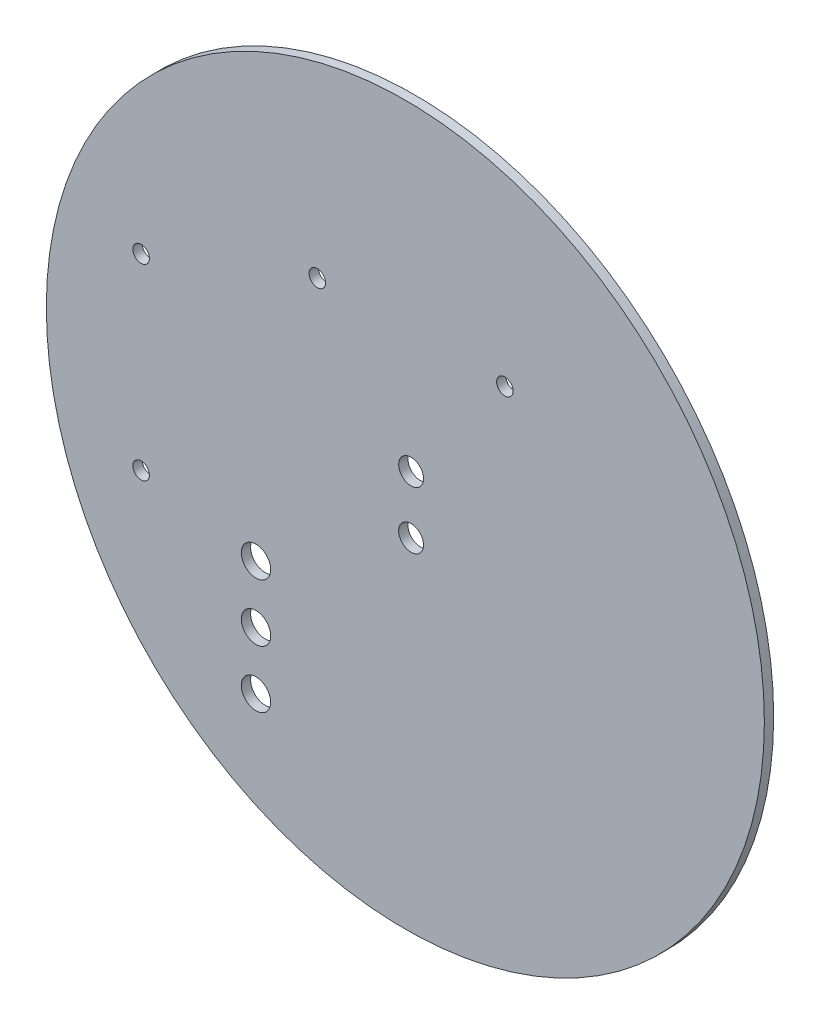
ISO-10303-21;
HEADER;
FILE_DESCRIPTION(('STEP AP214'),'2;1');
FILE_NAME('part.step','',(''),(''),'','','');
FILE_SCHEMA(('AUTOMOTIVE_DESIGN { 1 0 10303 214 1 1 1 1 }'));
ENDSEC;
DATA;
#1=APPLICATION_CONTEXT('core data for automotive mechanical design processes');
#2=APPLICATION_PROTOCOL_DEFINITION('international standard','automotive_design',2000,#1);
#3=PRODUCT_CONTEXT('',#1,'mechanical');
#4=PRODUCT('Part','Part','',(#3));
#5=PRODUCT_RELATED_PRODUCT_CATEGORY('part','',(#4));
#6=PRODUCT_DEFINITION_FORMATION('','',#4);
#7=PRODUCT_DEFINITION_CONTEXT('part definition',#1,'design');
#8=PRODUCT_DEFINITION('design','',#6,#7);
#9=PRODUCT_DEFINITION_SHAPE('','',#8);
#10=(LENGTH_UNIT() NAMED_UNIT(*) SI_UNIT(.MILLI.,.METRE.));
#11=(NAMED_UNIT(*) PLANE_ANGLE_UNIT() SI_UNIT($,.RADIAN.));
#12=(NAMED_UNIT(*) SI_UNIT($,.STERADIAN.) SOLID_ANGLE_UNIT());
#13=UNCERTAINTY_MEASURE_WITH_UNIT(LENGTH_MEASURE(1.E-05),#10,'distance_accuracy_value','');
#14=(GEOMETRIC_REPRESENTATION_CONTEXT(3) GLOBAL_UNCERTAINTY_ASSIGNED_CONTEXT((#13)) GLOBAL_UNIT_ASSIGNED_CONTEXT((#10,
#11,#12)) REPRESENTATION_CONTEXT('',''));
#15=CARTESIAN_POINT('',(0.,0.,0.));
#16=DIRECTION('',(0.,0.,1.));
#17=DIRECTION('',(1.,0.,0.));
#18=AXIS2_PLACEMENT_3D('',#15,#16,#17);
#19=CARTESIAN_POINT('',(103.12400054931,74.676002502441,0.));
#20=DIRECTION('',(0.,0.,1.));
#21=DIRECTION('',(1.,0.,0.));
#22=AXIS2_PLACEMENT_3D('',#19,#20,#21);
#23=PLANE('',#22);
#24=CARTESIAN_POINT('',(107.524,81.788,0.));
#25=DIRECTION('',(0.,0.,1.));
#26=DIRECTION('',(1.,0.,0.));
#27=AXIS2_PLACEMENT_3D('',#24,#25,#26);
#28=CIRCLE('',#27,0.365);
#29=CARTESIAN_POINT('',(107.889,81.788,0.));
#30=VERTEX_POINT('',#29);
#31=EDGE_CURVE('E26',#30,#30,#28,.T.);
#32=ORIENTED_EDGE('',*,*,#31,.F.);
#33=EDGE_LOOP('',(#32));
#34=FACE_BOUND('',#33,.T.);
#35=CARTESIAN_POINT('',(103.378,76.454,0.));
#36=DIRECTION('',(0.,0.,1.));
#37=DIRECTION('',(1.,0.,0.));
#38=AXIS2_PLACEMENT_3D('',#35,#36,#37);
#39=CIRCLE('',#38,0.55);
#40=CARTESIAN_POINT('',(103.928,76.454,0.));
#41=VERTEX_POINT('',#40);
#42=EDGE_CURVE('E132',#41,#41,#39,.T.);
#43=ORIENTED_EDGE('',*,*,#42,.F.);
#44=EDGE_LOOP('',(#43));
#45=FACE_BOUND('',#44,.T.);
#46=CARTESIAN_POINT('',(99.232,81.788,0.));
#47=DIRECTION('',(0.,0.,1.));
#48=DIRECTION('',(1.,0.,0.));
#49=AXIS2_PLACEMENT_3D('',#46,#47,#48);
#50=CIRCLE('',#49,0.365);
#51=CARTESIAN_POINT('',(99.597,81.788,0.));
#52=VERTEX_POINT('',#51);
#53=EDGE_CURVE('E125',#52,#52,#50,.T.);
#54=ORIENTED_EDGE('',*,*,#53,.F.);
#55=EDGE_LOOP('',(#54));
#56=FACE_BOUND('',#55,.T.);
#57=CARTESIAN_POINT('',(103.378,73.914,0.));
#58=DIRECTION('',(0.,0.,1.));
#59=DIRECTION('',(1.,0.,0.));
#60=AXIS2_PLACEMENT_3D('',#57,#58,#59);
#61=CIRCLE('',#60,0.55);
#62=CARTESIAN_POINT('',(103.928,73.914,0.));
#63=VERTEX_POINT('',#62);
#64=EDGE_CURVE('E205',#63,#63,#61,.T.);
#65=ORIENTED_EDGE('',*,*,#64,.F.);
#66=EDGE_LOOP('',(#65));
#67=FACE_BOUND('',#66,.T.);
#68=CARTESIAN_POINT('',(96.52,64.516,0.));
#69=DIRECTION('',(0.,0.,1.));
#70=DIRECTION('',(1.,0.,0.));
#71=AXIS2_PLACEMENT_3D('',#68,#69,#70);
#72=CIRCLE('',#71,0.65);
#73=CARTESIAN_POINT('',(97.17,64.516,0.));
#74=VERTEX_POINT('',#73);
#75=EDGE_CURVE('E164',#74,#74,#72,.T.);
#76=ORIENTED_EDGE('',*,*,#75,.F.);
#77=EDGE_LOOP('',(#76));
#78=FACE_BOUND('',#77,.T.);
#79=CARTESIAN_POINT('',(91.44,70.53,0.));
#80=DIRECTION('',(0.,0.,1.));
#81=DIRECTION('',(1.,0.,0.));
#82=AXIS2_PLACEMENT_3D('',#79,#80,#81);
#83=CIRCLE('',#82,0.365);
#84=CARTESIAN_POINT('',(91.805,70.53,0.));
#85=VERTEX_POINT('',#84);
#86=EDGE_CURVE('E157',#85,#85,#83,.T.);
#87=ORIENTED_EDGE('',*,*,#86,.F.);
#88=EDGE_LOOP('',(#87));
#89=FACE_BOUND('',#88,.T.);
#90=CARTESIAN_POINT('',(91.44,78.822,0.));
#91=DIRECTION('',(0.,0.,1.));
#92=DIRECTION('',(1.,0.,0.));
#93=AXIS2_PLACEMENT_3D('',#90,#91,#92);
#94=CIRCLE('',#93,0.365);
#95=CARTESIAN_POINT('',(91.805,78.822,0.));
#96=VERTEX_POINT('',#95);
#97=EDGE_CURVE('E165',#96,#96,#94,.T.);
#98=ORIENTED_EDGE('',*,*,#97,.F.);
#99=EDGE_LOOP('',(#98));
#100=FACE_BOUND('',#99,.T.);
#101=CARTESIAN_POINT('',(96.52,67.056,0.));
#102=DIRECTION('',(0.,0.,1.));
#103=DIRECTION('',(1.,0.,0.));
#104=AXIS2_PLACEMENT_3D('',#101,#102,#103);
#105=CIRCLE('',#104,0.65);
#106=CARTESIAN_POINT('',(97.17,67.056,0.));
#107=VERTEX_POINT('',#106);
#108=EDGE_CURVE('E149',#107,#107,#105,.T.);
#109=ORIENTED_EDGE('',*,*,#108,.F.);
#110=EDGE_LOOP('',(#109));
#111=FACE_BOUND('',#110,.T.);
#112=CARTESIAN_POINT('',(96.52,69.596,0.));
#113=DIRECTION('',(0.,0.,1.));
#114=DIRECTION('',(1.,0.,0.));
#115=AXIS2_PLACEMENT_3D('',#112,#113,#114);
#116=CIRCLE('',#115,0.65);
#117=CARTESIAN_POINT('',(97.17,69.596,0.));
#118=VERTEX_POINT('',#117);
#119=EDGE_CURVE('E141',#118,#118,#116,.T.);
#120=ORIENTED_EDGE('',*,*,#119,.F.);
#121=EDGE_LOOP('',(#120));
#122=FACE_BOUND('',#121,.T.);
#123=CARTESIAN_POINT('',(103.12400054931,74.676002502441,0.));
#124=DIRECTION('',(0.,0.,1.));
#125=DIRECTION('',(1.,0.,0.));
#126=AXIS2_PLACEMENT_3D('',#123,#124,#125);
#127=CIRCLE('',#126,15.875);
#128=CARTESIAN_POINT('',(118.99900054931,74.676002502441,0.));
#129=VERTEX_POINT('',#128);
#130=EDGE_CURVE('E174',#129,#129,#127,.T.);
#131=ORIENTED_EDGE('',*,*,#130,.T.);
#132=EDGE_LOOP('',(#131));
#133=FACE_BOUND('',#132,.T.);
#134=ADVANCED_FACE('F17',(#34,#45,#56,#67,#78,#89,#100,#111,#122,#133),#23,.T.);
#135=CARTESIAN_POINT('',(103.12400054931,74.676002502441,-0.41148));
#136=DIRECTION('',(0.,0.,1.));
#137=DIRECTION('',(1.,0.,0.));
#138=AXIS2_PLACEMENT_3D('',#135,#136,#137);
#139=PLANE('',#138);
#140=CARTESIAN_POINT('',(107.524,81.788,-0.41148));
#141=DIRECTION('',(0.,0.,1.));
#142=DIRECTION('',(1.,0.,0.));
#143=AXIS2_PLACEMENT_3D('',#140,#141,#142);
#144=CIRCLE('',#143,0.365);
#145=CARTESIAN_POINT('',(107.889,81.788,-0.41148));
#146=VERTEX_POINT('',#145);
#147=EDGE_CURVE('E11',#146,#146,#144,.T.);
#148=ORIENTED_EDGE('',*,*,#147,.T.);
#149=EDGE_LOOP('',(#148));
#150=FACE_BOUND('',#149,.T.);
#151=CARTESIAN_POINT('',(103.378,76.454,-0.41148));
#152=DIRECTION('',(0.,0.,1.));
#153=DIRECTION('',(1.,0.,0.));
#154=AXIS2_PLACEMENT_3D('',#151,#152,#153);
#155=CIRCLE('',#154,0.55);
#156=CARTESIAN_POINT('',(103.928,76.454,-0.41148));
#157=VERTEX_POINT('',#156);
#158=EDGE_CURVE('E193',#157,#157,#155,.T.);
#159=ORIENTED_EDGE('',*,*,#158,.T.);
#160=EDGE_LOOP('',(#159));
#161=FACE_BOUND('',#160,.T.);
#162=CARTESIAN_POINT('',(99.232,81.788,-0.41148));
#163=DIRECTION('',(0.,0.,1.));
#164=DIRECTION('',(1.,0.,0.));
#165=AXIS2_PLACEMENT_3D('',#162,#163,#164);
#166=CIRCLE('',#165,0.365);
#167=CARTESIAN_POINT('',(99.597,81.788,-0.41148));
#168=VERTEX_POINT('',#167);
#169=EDGE_CURVE('E117',#168,#168,#166,.T.);
#170=ORIENTED_EDGE('',*,*,#169,.T.);
#171=EDGE_LOOP('',(#170));
#172=FACE_BOUND('',#171,.T.);
#173=CARTESIAN_POINT('',(103.378,73.914,-0.41148));
#174=DIRECTION('',(0.,0.,1.));
#175=DIRECTION('',(1.,0.,0.));
#176=AXIS2_PLACEMENT_3D('',#173,#174,#175);
#177=CIRCLE('',#176,0.55);
#178=CARTESIAN_POINT('',(103.928,73.914,-0.41148));
#179=VERTEX_POINT('',#178);
#180=EDGE_CURVE('E152',#179,#179,#177,.T.);
#181=ORIENTED_EDGE('',*,*,#180,.T.);
#182=EDGE_LOOP('',(#181));
#183=FACE_BOUND('',#182,.T.);
#184=CARTESIAN_POINT('',(96.52,64.516,-0.41148));
#185=DIRECTION('',(0.,0.,1.));
#186=DIRECTION('',(1.,0.,0.));
#187=AXIS2_PLACEMENT_3D('',#184,#185,#186);
#188=CIRCLE('',#187,0.65);
#189=CARTESIAN_POINT('',(97.17,64.516,-0.41148));
#190=VERTEX_POINT('',#189);
#191=EDGE_CURVE('E160',#190,#190,#188,.T.);
#192=ORIENTED_EDGE('',*,*,#191,.T.);
#193=EDGE_LOOP('',(#192));
#194=FACE_BOUND('',#193,.T.);
#195=CARTESIAN_POINT('',(91.44,70.53,-0.41148));
#196=DIRECTION('',(0.,0.,1.));
#197=DIRECTION('',(1.,0.,0.));
#198=AXIS2_PLACEMENT_3D('',#195,#196,#197);
#199=CIRCLE('',#198,0.365);
#200=CARTESIAN_POINT('',(91.805,70.53,-0.41148));
#201=VERTEX_POINT('',#200);
#202=EDGE_CURVE('E153',#201,#201,#199,.T.);
#203=ORIENTED_EDGE('',*,*,#202,.T.);
#204=EDGE_LOOP('',(#203));
#205=FACE_BOUND('',#204,.T.);
#206=CARTESIAN_POINT('',(91.44,78.822,-0.41148));
#207=DIRECTION('',(0.,0.,1.));
#208=DIRECTION('',(1.,0.,0.));
#209=AXIS2_PLACEMENT_3D('',#206,#207,#208);
#210=CIRCLE('',#209,0.365);
#211=CARTESIAN_POINT('',(91.805,78.822,-0.41148));
#212=VERTEX_POINT('',#211);
#213=EDGE_CURVE('E168',#212,#212,#210,.T.);
#214=ORIENTED_EDGE('',*,*,#213,.T.);
#215=EDGE_LOOP('',(#214));
#216=FACE_BOUND('',#215,.T.);
#217=CARTESIAN_POINT('',(96.52,67.056,-0.41148));
#218=DIRECTION('',(0.,0.,1.));
#219=DIRECTION('',(1.,0.,0.));
#220=AXIS2_PLACEMENT_3D('',#217,#218,#219);
#221=CIRCLE('',#220,0.65);
#222=CARTESIAN_POINT('',(97.17,67.056,-0.41148));
#223=VERTEX_POINT('',#222);
#224=EDGE_CURVE('E145',#223,#223,#221,.T.);
#225=ORIENTED_EDGE('',*,*,#224,.T.);
#226=EDGE_LOOP('',(#225));
#227=FACE_BOUND('',#226,.T.);
#228=CARTESIAN_POINT('',(96.52,69.596,-0.41148));
#229=DIRECTION('',(0.,0.,1.));
#230=DIRECTION('',(1.,0.,0.));
#231=AXIS2_PLACEMENT_3D('',#228,#229,#230);
#232=CIRCLE('',#231,0.65);
#233=CARTESIAN_POINT('',(97.17,69.596,-0.41148));
#234=VERTEX_POINT('',#233);
#235=EDGE_CURVE('E143',#234,#234,#232,.T.);
#236=ORIENTED_EDGE('',*,*,#235,.T.);
#237=EDGE_LOOP('',(#236));
#238=FACE_BOUND('',#237,.T.);
#239=CARTESIAN_POINT('',(103.12400054931,74.676002502441,-0.41148));
#240=DIRECTION('',(0.,0.,1.));
#241=DIRECTION('',(1.,0.,0.));
#242=AXIS2_PLACEMENT_3D('',#239,#240,#241);
#243=CIRCLE('',#242,15.875);
#244=CARTESIAN_POINT('',(118.99900054931,74.676002502441,-0.41148));
#245=VERTEX_POINT('',#244);
#246=EDGE_CURVE('E190',#245,#245,#243,.T.);
#247=ORIENTED_EDGE('',*,*,#246,.F.);
#248=EDGE_LOOP('',(#247));
#249=FACE_BOUND('',#248,.T.);
#250=ADVANCED_FACE('F118',(#150,#161,#172,#183,#194,#205,#216,#227,#238,#249),#139,.F.);
#251=CARTESIAN_POINT('',(107.524,81.788,-0.41148));
#252=DIRECTION('',(0.,0.,-1.));
#253=DIRECTION('',(1.,0.,0.));
#254=AXIS2_PLACEMENT_3D('',#251,#252,#253);
#255=CYLINDRICAL_SURFACE('',#254,0.365);
#256=DIRECTION('',(0.,0.,1.));
#257=VECTOR('',#256,1.);
#258=CARTESIAN_POINT('',(107.889,81.788,-0.41148));
#259=LINE('',#258,#257);
#260=EDGE_CURVE('E20',#146,#30,#259,.T.);
#261=ORIENTED_EDGE('',*,*,#260,.T.);
#262=ORIENTED_EDGE('',*,*,#31,.T.);
#263=ORIENTED_EDGE('',*,*,#260,.F.);
#264=ORIENTED_EDGE('',*,*,#147,.F.);
#265=EDGE_LOOP('',(#261,#262,#263,#264));
#266=FACE_BOUND('',#265,.T.);
#267=ADVANCED_FACE('F260',(#266),#255,.F.);
#268=CARTESIAN_POINT('',(103.378,76.454,-0.41148));
#269=DIRECTION('',(0.,0.,-1.));
#270=DIRECTION('',(1.,0.,0.));
#271=AXIS2_PLACEMENT_3D('',#268,#269,#270);
#272=CYLINDRICAL_SURFACE('',#271,0.55);
#273=DIRECTION('',(0.,0.,1.));
#274=VECTOR('',#273,1.);
#275=CARTESIAN_POINT('',(103.928,76.454,-0.41148));
#276=LINE('',#275,#274);
#277=EDGE_CURVE('E124',#157,#41,#276,.T.);
#278=ORIENTED_EDGE('',*,*,#277,.T.);
#279=ORIENTED_EDGE('',*,*,#42,.T.);
#280=ORIENTED_EDGE('',*,*,#277,.F.);
#281=ORIENTED_EDGE('',*,*,#158,.F.);
#282=EDGE_LOOP('',(#278,#279,#280,#281));
#283=FACE_BOUND('',#282,.T.);
#284=ADVANCED_FACE('F224',(#283),#272,.F.);
#285=CARTESIAN_POINT('',(99.232,81.788,-0.41148));
#286=DIRECTION('',(0.,0.,-1.));
#287=DIRECTION('',(1.,0.,0.));
#288=AXIS2_PLACEMENT_3D('',#285,#286,#287);
#289=CYLINDRICAL_SURFACE('',#288,0.365);
#290=DIRECTION('',(0.,0.,1.));
#291=VECTOR('',#290,1.);
#292=CARTESIAN_POINT('',(99.597,81.788,-0.41148));
#293=LINE('',#292,#291);
#294=EDGE_CURVE('E135',#168,#52,#293,.T.);
#295=ORIENTED_EDGE('',*,*,#294,.T.);
#296=ORIENTED_EDGE('',*,*,#53,.T.);
#297=ORIENTED_EDGE('',*,*,#294,.F.);
#298=ORIENTED_EDGE('',*,*,#169,.F.);
#299=EDGE_LOOP('',(#295,#296,#297,#298));
#300=FACE_BOUND('',#299,.T.);
#301=ADVANCED_FACE('F278',(#300),#289,.F.);
#302=CARTESIAN_POINT('',(103.378,73.914,-0.41148));
#303=DIRECTION('',(0.,0.,-1.));
#304=DIRECTION('',(1.,0.,0.));
#305=AXIS2_PLACEMENT_3D('',#302,#303,#304);
#306=CYLINDRICAL_SURFACE('',#305,0.55);
#307=DIRECTION('',(0.,0.,1.));
#308=VECTOR('',#307,1.);
#309=CARTESIAN_POINT('',(103.928,73.914,-0.41148));
#310=LINE('',#309,#308);
#311=EDGE_CURVE('E163',#179,#63,#310,.T.);
#312=ORIENTED_EDGE('',*,*,#311,.T.);
#313=ORIENTED_EDGE('',*,*,#64,.T.);
#314=ORIENTED_EDGE('',*,*,#311,.F.);
#315=ORIENTED_EDGE('',*,*,#180,.F.);
#316=EDGE_LOOP('',(#312,#313,#314,#315));
#317=FACE_BOUND('',#316,.T.);
#318=ADVANCED_FACE('F275',(#317),#306,.F.);
#319=CARTESIAN_POINT('',(96.52,64.516,-0.41148));
#320=DIRECTION('',(0.,0.,-1.));
#321=DIRECTION('',(1.,0.,0.));
#322=AXIS2_PLACEMENT_3D('',#319,#320,#321);
#323=CYLINDRICAL_SURFACE('',#322,0.65);
#324=DIRECTION('',(0.,0.,1.));
#325=VECTOR('',#324,1.);
#326=CARTESIAN_POINT('',(97.17,64.516,-0.41148));
#327=LINE('',#326,#325);
#328=EDGE_CURVE('E156',#190,#74,#327,.T.);
#329=ORIENTED_EDGE('',*,*,#328,.T.);
#330=ORIENTED_EDGE('',*,*,#75,.T.);
#331=ORIENTED_EDGE('',*,*,#328,.F.);
#332=ORIENTED_EDGE('',*,*,#191,.F.);
#333=EDGE_LOOP('',(#329,#330,#331,#332));
#334=FACE_BOUND('',#333,.T.);
#335=ADVANCED_FACE('F277',(#334),#323,.F.);
#336=CARTESIAN_POINT('',(91.44,70.53,-0.41148));
#337=DIRECTION('',(0.,0.,-1.));
#338=DIRECTION('',(1.,0.,0.));
#339=AXIS2_PLACEMENT_3D('',#336,#337,#338);
#340=CYLINDRICAL_SURFACE('',#339,0.365);
#341=DIRECTION('',(0.,0.,1.));
#342=VECTOR('',#341,1.);
#343=CARTESIAN_POINT('',(91.805,70.53,-0.41148));
#344=LINE('',#343,#342);
#345=EDGE_CURVE('E139',#201,#85,#344,.T.);
#346=ORIENTED_EDGE('',*,*,#345,.T.);
#347=ORIENTED_EDGE('',*,*,#86,.T.);
#348=ORIENTED_EDGE('',*,*,#345,.F.);
#349=ORIENTED_EDGE('',*,*,#202,.F.);
#350=EDGE_LOOP('',(#346,#347,#348,#349));
#351=FACE_BOUND('',#350,.T.);
#352=ADVANCED_FACE('F285',(#351),#340,.F.);
#353=CARTESIAN_POINT('',(91.44,78.822,-0.41148));
#354=DIRECTION('',(0.,0.,-1.));
#355=DIRECTION('',(1.,0.,0.));
#356=AXIS2_PLACEMENT_3D('',#353,#354,#355);
#357=CYLINDRICAL_SURFACE('',#356,0.365);
#358=DIRECTION('',(0.,0.,1.));
#359=VECTOR('',#358,1.);
#360=CARTESIAN_POINT('',(91.805,78.822,-0.41148));
#361=LINE('',#360,#359);
#362=EDGE_CURVE('E148',#212,#96,#361,.T.);
#363=ORIENTED_EDGE('',*,*,#362,.T.);
#364=ORIENTED_EDGE('',*,*,#97,.T.);
#365=ORIENTED_EDGE('',*,*,#362,.F.);
#366=ORIENTED_EDGE('',*,*,#213,.F.);
#367=EDGE_LOOP('',(#363,#364,#365,#366));
#368=FACE_BOUND('',#367,.T.);
#369=ADVANCED_FACE('F293',(#368),#357,.F.);
#370=CARTESIAN_POINT('',(96.52,67.056,-0.41148));
#371=DIRECTION('',(0.,0.,-1.));
#372=DIRECTION('',(1.,0.,0.));
#373=AXIS2_PLACEMENT_3D('',#370,#371,#372);
#374=CYLINDRICAL_SURFACE('',#373,0.65);
#375=DIRECTION('',(0.,0.,1.));
#376=VECTOR('',#375,1.);
#377=CARTESIAN_POINT('',(97.17,67.056,-0.41148));
#378=LINE('',#377,#376);
#379=EDGE_CURVE('E169',#223,#107,#378,.T.);
#380=ORIENTED_EDGE('',*,*,#379,.T.);
#381=ORIENTED_EDGE('',*,*,#108,.T.);
#382=ORIENTED_EDGE('',*,*,#379,.F.);
#383=ORIENTED_EDGE('',*,*,#224,.F.);
#384=EDGE_LOOP('',(#380,#381,#382,#383));
#385=FACE_BOUND('',#384,.T.);
#386=ADVANCED_FACE('F256',(#385),#374,.F.);
#387=CARTESIAN_POINT('',(96.52,69.596,-0.41148));
#388=DIRECTION('',(0.,0.,-1.));
#389=DIRECTION('',(1.,0.,0.));
#390=AXIS2_PLACEMENT_3D('',#387,#388,#389);
#391=CYLINDRICAL_SURFACE('',#390,0.65);
#392=DIRECTION('',(0.,0.,1.));
#393=VECTOR('',#392,1.);
#394=CARTESIAN_POINT('',(97.17,69.596,-0.41148));
#395=LINE('',#394,#393);
#396=EDGE_CURVE('E144',#234,#118,#395,.T.);
#397=ORIENTED_EDGE('',*,*,#396,.T.);
#398=ORIENTED_EDGE('',*,*,#119,.T.);
#399=ORIENTED_EDGE('',*,*,#396,.F.);
#400=ORIENTED_EDGE('',*,*,#235,.F.);
#401=EDGE_LOOP('',(#397,#398,#399,#400));
#402=FACE_BOUND('',#401,.T.);
#403=ADVANCED_FACE('F244',(#402),#391,.F.);
#404=CARTESIAN_POINT('',(103.12400054931,74.676002502441,-0.41148));
#405=DIRECTION('',(0.,0.,-1.));
#406=DIRECTION('',(1.,0.,0.));
#407=AXIS2_PLACEMENT_3D('',#404,#405,#406);
#408=CYLINDRICAL_SURFACE('',#407,15.875);
#409=ORIENTED_EDGE('',*,*,#246,.T.);
#410=DIRECTION('',(0.,0.,1.));
#411=VECTOR('',#410,1.);
#412=CARTESIAN_POINT('',(118.99900054931,74.676002502441,-0.41148));
#413=LINE('',#412,#411);
#414=EDGE_CURVE('E181',#245,#129,#413,.T.);
#415=ORIENTED_EDGE('',*,*,#414,.T.);
#416=ORIENTED_EDGE('',*,*,#130,.F.);
#417=ORIENTED_EDGE('',*,*,#414,.F.);
#418=EDGE_LOOP('',(#409,#415,#416,#417));
#419=FACE_BOUND('',#418,.T.);
#420=ADVANCED_FACE('F291',(#419),#408,.T.);
#421=CLOSED_SHELL('',(#134,#250,#267,#284,#301,#318,#335,#352,#369,#386,#403,#420));
#422=MANIFOLD_SOLID_BREP('B1',#421);
#423=ADVANCED_BREP_SHAPE_REPRESENTATION('',(#18,#422),#14);
#424=SHAPE_DEFINITION_REPRESENTATION(#9,#423);
ENDSEC;
END-ISO-10303-21;
